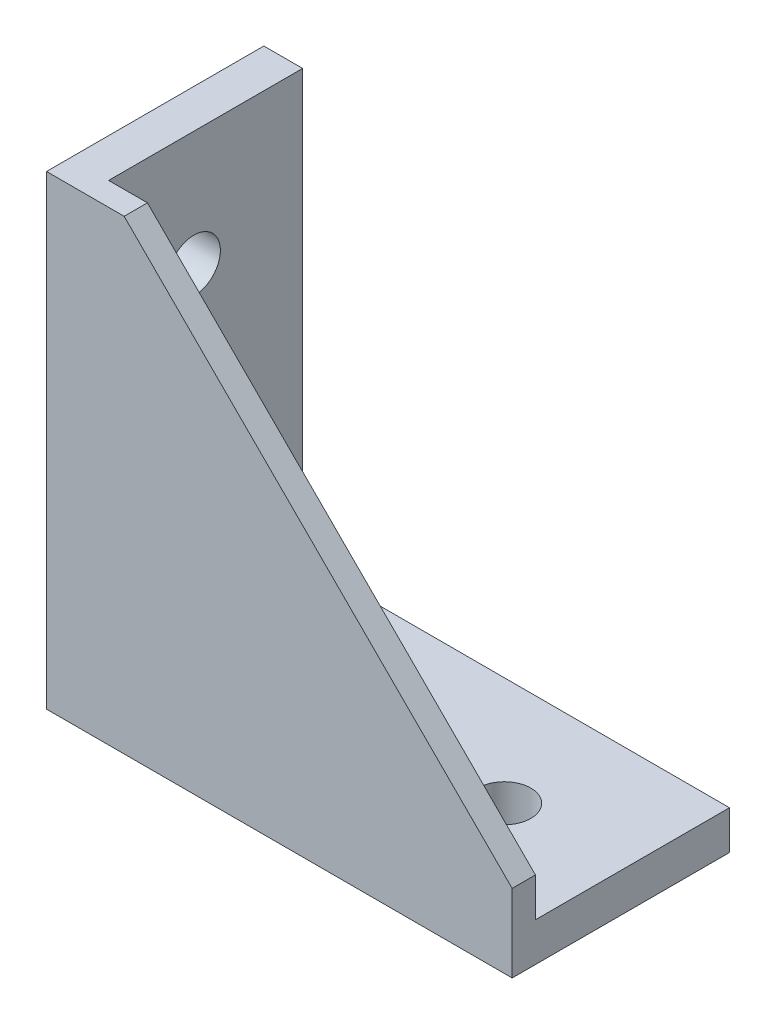
ISO-10303-21;
HEADER;
FILE_DESCRIPTION(('STEP AP214'),'2;1');
FILE_NAME('part.step','',(''),(''),'','','');
FILE_SCHEMA(('AUTOMOTIVE_DESIGN { 1 0 10303 214 1 1 1 1 }'));
ENDSEC;
DATA;
#1=APPLICATION_CONTEXT('core data for automotive mechanical design processes');
#2=APPLICATION_PROTOCOL_DEFINITION('international standard','automotive_design',2000,#1);
#3=PRODUCT_CONTEXT('',#1,'mechanical');
#4=PRODUCT('Part','Part','',(#3));
#5=PRODUCT_RELATED_PRODUCT_CATEGORY('part','',(#4));
#6=PRODUCT_DEFINITION_FORMATION('','',#4);
#7=PRODUCT_DEFINITION_CONTEXT('part definition',#1,'design');
#8=PRODUCT_DEFINITION('design','',#6,#7);
#9=PRODUCT_DEFINITION_SHAPE('','',#8);
#10=(LENGTH_UNIT() NAMED_UNIT(*) SI_UNIT(.MILLI.,.METRE.));
#11=(NAMED_UNIT(*) PLANE_ANGLE_UNIT() SI_UNIT($,.RADIAN.));
#12=(NAMED_UNIT(*) SI_UNIT($,.STERADIAN.) SOLID_ANGLE_UNIT());
#13=UNCERTAINTY_MEASURE_WITH_UNIT(LENGTH_MEASURE(1.E-05),#10,'distance_accuracy_value','');
#14=(GEOMETRIC_REPRESENTATION_CONTEXT(3) GLOBAL_UNCERTAINTY_ASSIGNED_CONTEXT((#13)) GLOBAL_UNIT_ASSIGNED_CONTEXT((#10,
#11,#12)) REPRESENTATION_CONTEXT('',''));
#15=CARTESIAN_POINT('',(0.,0.,0.));
#16=DIRECTION('',(0.,0.,1.));
#17=DIRECTION('',(1.,0.,0.));
#18=AXIS2_PLACEMENT_3D('',#15,#16,#17);
#19=CARTESIAN_POINT('',(0.,0.,14.));
#20=DIRECTION('',(0.,1.,0.));
#21=DIRECTION('',(0.,0.,1.));
#22=AXIS2_PLACEMENT_3D('',#19,#20,#21);
#23=PLANE('',#22);
#24=DIRECTION('',(0.,0.,1.));
#25=VECTOR('',#24,1.);
#26=CARTESIAN_POINT('',(5.5,0.,-4.));
#27=LINE('',#26,#25);
#28=CARTESIAN_POINT('',(5.5,0.,-4.));
#29=VERTEX_POINT('',#28);
#30=CARTESIAN_POINT('',(5.5,0.,4.));
#31=VERTEX_POINT('',#30);
#32=EDGE_CURVE('E395',#29,#31,#27,.T.);
#33=ORIENTED_EDGE('',*,*,#32,.F.);
#34=DIRECTION('',(1.,0.,0.));
#35=VECTOR('',#34,1.);
#36=CARTESIAN_POINT('',(3.,0.,-4.));
#37=LINE('',#36,#35);
#38=CARTESIAN_POINT('',(3.,0.,-4.));
#39=VERTEX_POINT('',#38);
#40=EDGE_CURVE('E400',#39,#29,#37,.T.);
#41=ORIENTED_EDGE('',*,*,#40,.F.);
#42=DIRECTION('',(0.,0.,-1.));
#43=VECTOR('',#42,1.);
#44=CARTESIAN_POINT('',(3.,0.,-4.));
#45=LINE('',#44,#43);
#46=CARTESIAN_POINT('',(3.,0.,4.));
#47=VERTEX_POINT('',#46);
#48=EDGE_CURVE('E412',#47,#39,#45,.T.);
#49=ORIENTED_EDGE('',*,*,#48,.F.);
#50=DIRECTION('',(-1.,0.,0.));
#51=VECTOR('',#50,1.);
#52=CARTESIAN_POINT('',(3.,0.,4.));
#53=LINE('',#52,#51);
#54=EDGE_CURVE('E409',#31,#47,#53,.T.);
#55=ORIENTED_EDGE('',*,*,#54,.F.);
#56=EDGE_LOOP('',(#33,#41,#49,#55));
#57=FACE_BOUND('',#56,.T.);
#58=DIRECTION('',(-1.,0.,0.));
#59=VECTOR('',#58,1.);
#60=CARTESIAN_POINT('',(18.,0.,-3.4));
#61=LINE('',#60,#59);
#62=CARTESIAN_POINT('',(31.5,0.,-3.4));
#63=VERTEX_POINT('',#62);
#64=CARTESIAN_POINT('',(18.,0.,-3.4));
#65=VERTEX_POINT('',#64);
#66=EDGE_CURVE('E439',#63,#65,#61,.T.);
#67=ORIENTED_EDGE('',*,*,#66,.T.);
#68=CARTESIAN_POINT('',(18.,0.,0.));
#69=DIRECTION('',(0.,1.,0.));
#70=DIRECTION('',(0.,0.,1.));
#71=AXIS2_PLACEMENT_3D('',#68,#69,#70);
#72=CIRCLE('',#71,3.4);
#73=CARTESIAN_POINT('',(18.,0.,3.4));
#74=VERTEX_POINT('',#73);
#75=EDGE_CURVE('E429',#65,#74,#72,.T.);
#76=ORIENTED_EDGE('',*,*,#75,.T.);
#77=DIRECTION('',(1.,0.,0.));
#78=VECTOR('',#77,1.);
#79=CARTESIAN_POINT('',(18.,0.,3.4));
#80=LINE('',#79,#78);
#81=CARTESIAN_POINT('',(31.5,0.,3.4));
#82=VERTEX_POINT('',#81);
#83=EDGE_CURVE('E432',#74,#82,#80,.T.);
#84=ORIENTED_EDGE('',*,*,#83,.T.);
#85=CARTESIAN_POINT('',(31.5,0.,0.));
#86=DIRECTION('',(0.,1.,0.));
#87=DIRECTION('',(0.,0.,1.));
#88=AXIS2_PLACEMENT_3D('',#85,#86,#87);
#89=CIRCLE('',#88,3.4);
#90=EDGE_CURVE('E436',#82,#63,#89,.T.);
#91=ORIENTED_EDGE('',*,*,#90,.T.);
#92=EDGE_LOOP('',(#67,#76,#84,#91));
#93=FACE_BOUND('',#92,.T.);
#94=CARTESIAN_POINT('',(45.,0.,0.));
#95=DIRECTION('',(0.,1.,0.));
#96=DIRECTION('',(0.,0.,1.));
#97=AXIS2_PLACEMENT_3D('',#94,#95,#96);
#98=CIRCLE('',#97,3.4);
#99=CARTESIAN_POINT('',(45.,0.,3.4));
#100=VERTEX_POINT('',#99);
#101=EDGE_CURVE('E446',#100,#100,#98,.T.);
#102=ORIENTED_EDGE('',*,*,#101,.T.);
#103=EDGE_LOOP('',(#102));
#104=FACE_BOUND('',#103,.T.);
#105=DIRECTION('',(1.,0.,0.));
#106=VECTOR('',#105,1.);
#107=CARTESIAN_POINT('',(0.,0.,-14.));
#108=LINE('',#107,#106);
#109=CARTESIAN_POINT('',(0.,0.,-14.));
#110=VERTEX_POINT('',#109);
#111=CARTESIAN_POINT('',(60.,0.,-14.));
#112=VERTEX_POINT('',#111);
#113=EDGE_CURVE('E506',#110,#112,#108,.T.);
#114=ORIENTED_EDGE('',*,*,#113,.T.);
#115=DIRECTION('',(0.,0.,-1.));
#116=VECTOR('',#115,1.);
#117=CARTESIAN_POINT('',(60.,0.,14.));
#118=LINE('',#117,#116);
#119=CARTESIAN_POINT('',(60.,0.,14.));
#120=VERTEX_POINT('',#119);
#121=EDGE_CURVE('E521',#120,#112,#118,.T.);
#122=ORIENTED_EDGE('',*,*,#121,.F.);
#123=DIRECTION('',(1.,0.,0.));
#124=VECTOR('',#123,1.);
#125=CARTESIAN_POINT('',(0.,0.,14.));
#126=LINE('',#125,#124);
#127=CARTESIAN_POINT('',(0.,0.,14.));
#128=VERTEX_POINT('',#127);
#129=EDGE_CURVE('E497',#128,#120,#126,.T.);
#130=ORIENTED_EDGE('',*,*,#129,.F.);
#131=DIRECTION('',(0.,0.,-1.));
#132=VECTOR('',#131,1.);
#133=CARTESIAN_POINT('',(0.,0.,14.));
#134=LINE('',#133,#132);
#135=EDGE_CURVE('E54',#128,#110,#134,.T.);
#136=ORIENTED_EDGE('',*,*,#135,.T.);
#137=EDGE_LOOP('',(#114,#122,#130,#136));
#138=FACE_BOUND('',#137,.T.);
#139=DIRECTION('',(0.,0.,1.));
#140=VECTOR('',#139,1.);
#141=CARTESIAN_POINT('',(57.,0.,-4.));
#142=LINE('',#141,#140);
#143=CARTESIAN_POINT('',(57.,0.,-4.));
#144=VERTEX_POINT('',#143);
#145=CARTESIAN_POINT('',(57.,0.,4.));
#146=VERTEX_POINT('',#145);
#147=EDGE_CURVE('E352',#144,#146,#142,.T.);
#148=ORIENTED_EDGE('',*,*,#147,.F.);
#149=DIRECTION('',(1.,0.,0.));
#150=VECTOR('',#149,1.);
#151=CARTESIAN_POINT('',(54.5,0.,-4.));
#152=LINE('',#151,#150);
#153=CARTESIAN_POINT('',(54.5,0.,-4.));
#154=VERTEX_POINT('',#153);
#155=EDGE_CURVE('E367',#154,#144,#152,.T.);
#156=ORIENTED_EDGE('',*,*,#155,.F.);
#157=DIRECTION('',(0.,0.,-1.));
#158=VECTOR('',#157,1.);
#159=CARTESIAN_POINT('',(54.5,0.,-4.));
#160=LINE('',#159,#158);
#161=CARTESIAN_POINT('',(54.5,0.,4.));
#162=VERTEX_POINT('',#161);
#163=EDGE_CURVE('E379',#162,#154,#160,.T.);
#164=ORIENTED_EDGE('',*,*,#163,.F.);
#165=DIRECTION('',(-1.,0.,0.));
#166=VECTOR('',#165,1.);
#167=CARTESIAN_POINT('',(54.5,0.,4.));
#168=LINE('',#167,#166);
#169=EDGE_CURVE('E376',#146,#162,#168,.T.);
#170=ORIENTED_EDGE('',*,*,#169,.F.);
#171=EDGE_LOOP('',(#148,#156,#164,#170));
#172=FACE_BOUND('',#171,.T.);
#173=ADVANCED_FACE('F46',(#57,#93,#104,#138,#172),#23,.F.);
#174=CARTESIAN_POINT('',(5.,60.,14.));
#175=DIRECTION('',(0.,-1.,0.));
#176=DIRECTION('',(0.,0.,-1.));
#177=AXIS2_PLACEMENT_3D('',#174,#175,#176);
#178=PLANE('',#177);
#179=DIRECTION('',(-1.,0.,0.));
#180=VECTOR('',#179,1.);
#181=CARTESIAN_POINT('',(5.,60.,-14.));
#182=LINE('',#181,#180);
#183=CARTESIAN_POINT('',(5.,60.,-14.));
#184=VERTEX_POINT('',#183);
#185=CARTESIAN_POINT('',(0.,60.,-14.));
#186=VERTEX_POINT('',#185);
#187=EDGE_CURVE('E488',#184,#186,#182,.T.);
#188=ORIENTED_EDGE('',*,*,#187,.T.);
#189=DIRECTION('',(0.,0.,-1.));
#190=VECTOR('',#189,1.);
#191=CARTESIAN_POINT('',(0.,60.,14.));
#192=LINE('',#191,#190);
#193=CARTESIAN_POINT('',(0.,60.,14.));
#194=VERTEX_POINT('',#193);
#195=EDGE_CURVE('E13',#194,#186,#192,.T.);
#196=ORIENTED_EDGE('',*,*,#195,.F.);
#197=DIRECTION('',(-1.,0.,0.));
#198=VECTOR('',#197,1.);
#199=CARTESIAN_POINT('',(5.,60.,14.));
#200=LINE('',#199,#198);
#201=CARTESIAN_POINT('',(10.,60.,14.));
#202=VERTEX_POINT('',#201);
#203=EDGE_CURVE('E491',#202,#194,#200,.T.);
#204=ORIENTED_EDGE('',*,*,#203,.F.);
#205=DIRECTION('',(0.,0.,1.));
#206=VECTOR('',#205,1.);
#207=CARTESIAN_POINT('',(10.,60.,11.));
#208=LINE('',#207,#206);
#209=CARTESIAN_POINT('',(10.,60.,11.));
#210=VERTEX_POINT('',#209);
#211=EDGE_CURVE('E485',#210,#202,#208,.T.);
#212=ORIENTED_EDGE('',*,*,#211,.F.);
#213=DIRECTION('',(-1.,0.,0.));
#214=VECTOR('',#213,1.);
#215=CARTESIAN_POINT('',(5.,60.,11.));
#216=LINE('',#215,#214);
#217=CARTESIAN_POINT('',(5.,60.,11.));
#218=VERTEX_POINT('',#217);
#219=EDGE_CURVE('E467',#210,#218,#216,.T.);
#220=ORIENTED_EDGE('',*,*,#219,.T.);
#221=DIRECTION('',(0.,0.,-1.));
#222=VECTOR('',#221,1.);
#223=CARTESIAN_POINT('',(5.,60.,14.));
#224=LINE('',#223,#222);
#225=EDGE_CURVE('E501',#218,#184,#224,.T.);
#226=ORIENTED_EDGE('',*,*,#225,.T.);
#227=EDGE_LOOP('',(#188,#196,#204,#212,#220,#226));
#228=FACE_BOUND('',#227,.T.);
#229=ADVANCED_FACE('F48',(#228),#178,.F.);
#230=CARTESIAN_POINT('',(0.,60.,14.));
#231=DIRECTION('',(1.,0.,0.));
#232=DIRECTION('',(0.,1.,0.));
#233=AXIS2_PLACEMENT_3D('',#230,#231,#232);
#234=PLANE('',#233);
#235=DIRECTION('',(0.,1.,0.));
#236=VECTOR('',#235,1.);
#237=CARTESIAN_POINT('',(0.,54.5,-4.));
#238=LINE('',#237,#236);
#239=CARTESIAN_POINT('',(0.,54.5,-4.));
#240=VERTEX_POINT('',#239);
#241=CARTESIAN_POINT('',(0.,57.,-4.));
#242=VERTEX_POINT('',#241);
#243=EDGE_CURVE('E287',#240,#242,#238,.T.);
#244=ORIENTED_EDGE('',*,*,#243,.T.);
#245=DIRECTION('',(0.,0.,1.));
#246=VECTOR('',#245,1.);
#247=CARTESIAN_POINT('',(0.,57.,-4.));
#248=LINE('',#247,#246);
#249=CARTESIAN_POINT('',(0.,57.,4.));
#250=VERTEX_POINT('',#249);
#251=EDGE_CURVE('E261',#242,#250,#248,.T.);
#252=ORIENTED_EDGE('',*,*,#251,.T.);
#253=DIRECTION('',(0.,-1.,0.));
#254=VECTOR('',#253,1.);
#255=CARTESIAN_POINT('',(0.,54.5,4.));
#256=LINE('',#255,#254);
#257=CARTESIAN_POINT('',(0.,54.5,4.));
#258=VERTEX_POINT('',#257);
#259=EDGE_CURVE('E277',#250,#258,#256,.T.);
#260=ORIENTED_EDGE('',*,*,#259,.T.);
#261=DIRECTION('',(0.,0.,-1.));
#262=VECTOR('',#261,1.);
#263=CARTESIAN_POINT('',(0.,54.5,-4.));
#264=LINE('',#263,#262);
#265=EDGE_CURVE('E61',#258,#240,#264,.T.);
#266=ORIENTED_EDGE('',*,*,#265,.T.);
#267=EDGE_LOOP('',(#244,#252,#260,#266));
#268=FACE_BOUND('',#267,.T.);
#269=DIRECTION('',(0.,1.,0.));
#270=VECTOR('',#269,1.);
#271=CARTESIAN_POINT('',(0.,3.,-4.));
#272=LINE('',#271,#270);
#273=CARTESIAN_POINT('',(0.,3.,-4.));
#274=VERTEX_POINT('',#273);
#275=CARTESIAN_POINT('',(0.,5.5,-4.));
#276=VERTEX_POINT('',#275);
#277=EDGE_CURVE('E312',#274,#276,#272,.T.);
#278=ORIENTED_EDGE('',*,*,#277,.T.);
#279=DIRECTION('',(0.,0.,1.));
#280=VECTOR('',#279,1.);
#281=CARTESIAN_POINT('',(0.,5.5,-4.));
#282=LINE('',#281,#280);
#283=CARTESIAN_POINT('',(0.,5.5,4.));
#284=VERTEX_POINT('',#283);
#285=EDGE_CURVE('E266',#276,#284,#282,.T.);
#286=ORIENTED_EDGE('',*,*,#285,.T.);
#287=DIRECTION('',(0.,-1.,0.));
#288=VECTOR('',#287,1.);
#289=CARTESIAN_POINT('',(0.,3.,4.));
#290=LINE('',#289,#288);
#291=CARTESIAN_POINT('',(0.,3.,4.));
#292=VERTEX_POINT('',#291);
#293=EDGE_CURVE('E300',#284,#292,#290,.T.);
#294=ORIENTED_EDGE('',*,*,#293,.T.);
#295=DIRECTION('',(0.,0.,-1.));
#296=VECTOR('',#295,1.);
#297=CARTESIAN_POINT('',(0.,3.,-4.));
#298=LINE('',#297,#296);
#299=EDGE_CURVE('E69',#292,#274,#298,.T.);
#300=ORIENTED_EDGE('',*,*,#299,.T.);
#301=EDGE_LOOP('',(#278,#286,#294,#300));
#302=FACE_BOUND('',#301,.T.);
#303=CARTESIAN_POINT('',(0.,18.,0.));
#304=DIRECTION('',(-1.,0.,0.));
#305=DIRECTION('',(0.,0.,1.));
#306=AXIS2_PLACEMENT_3D('',#303,#304,#305);
#307=CIRCLE('',#306,3.4);
#308=CARTESIAN_POINT('',(0.,18.,-3.4));
#309=VERTEX_POINT('',#308);
#310=CARTESIAN_POINT('',(0.,18.,3.4));
#311=VERTEX_POINT('',#310);
#312=EDGE_CURVE('E326',#309,#311,#307,.T.);
#313=ORIENTED_EDGE('',*,*,#312,.F.);
#314=DIRECTION('',(0.,-1.,0.));
#315=VECTOR('',#314,1.);
#316=CARTESIAN_POINT('',(0.,18.,-3.4));
#317=LINE('',#316,#315);
#318=CARTESIAN_POINT('',(0.,31.5,-3.4));
#319=VERTEX_POINT('',#318);
#320=EDGE_CURVE('E328',#319,#309,#317,.T.);
#321=ORIENTED_EDGE('',*,*,#320,.F.);
#322=CARTESIAN_POINT('',(0.,31.5,0.));
#323=DIRECTION('',(-1.,0.,0.));
#324=DIRECTION('',(0.,0.,1.));
#325=AXIS2_PLACEMENT_3D('',#322,#323,#324);
#326=CIRCLE('',#325,3.4);
#327=CARTESIAN_POINT('',(0.,31.5,3.4));
#328=VERTEX_POINT('',#327);
#329=EDGE_CURVE('E331',#328,#319,#326,.T.);
#330=ORIENTED_EDGE('',*,*,#329,.F.);
#331=DIRECTION('',(0.,1.,0.));
#332=VECTOR('',#331,1.);
#333=CARTESIAN_POINT('',(0.,18.,3.4));
#334=LINE('',#333,#332);
#335=EDGE_CURVE('E334',#311,#328,#334,.T.);
#336=ORIENTED_EDGE('',*,*,#335,.F.);
#337=EDGE_LOOP('',(#313,#321,#330,#336));
#338=FACE_BOUND('',#337,.T.);
#339=CARTESIAN_POINT('',(0.,45.,0.));
#340=DIRECTION('',(-1.,0.,0.));
#341=DIRECTION('',(0.,0.,1.));
#342=AXIS2_PLACEMENT_3D('',#339,#340,#341);
#343=CIRCLE('',#342,3.4);
#344=CARTESIAN_POINT('',(0.,45.,3.4));
#345=VERTEX_POINT('',#344);
#346=EDGE_CURVE('E341',#345,#345,#343,.T.);
#347=ORIENTED_EDGE('',*,*,#346,.F.);
#348=EDGE_LOOP('',(#347));
#349=FACE_BOUND('',#348,.T.);
#350=DIRECTION('',(0.,-1.,0.));
#351=VECTOR('',#350,1.);
#352=CARTESIAN_POINT('',(0.,60.,-14.));
#353=LINE('',#352,#351);
#354=EDGE_CURVE('E504',#186,#110,#353,.T.);
#355=ORIENTED_EDGE('',*,*,#354,.T.);
#356=ORIENTED_EDGE('',*,*,#135,.F.);
#357=DIRECTION('',(0.,-1.,0.));
#358=VECTOR('',#357,1.);
#359=CARTESIAN_POINT('',(0.,60.,14.));
#360=LINE('',#359,#358);
#361=EDGE_CURVE('E494',#194,#128,#360,.T.);
#362=ORIENTED_EDGE('',*,*,#361,.F.);
#363=ORIENTED_EDGE('',*,*,#195,.T.);
#364=EDGE_LOOP('',(#355,#356,#362,#363));
#365=FACE_BOUND('',#364,.T.);
#366=ADVANCED_FACE('F545',(#268,#302,#338,#349,#365),#234,.F.);
#367=CARTESIAN_POINT('',(60.,0.,14.));
#368=DIRECTION('',(-1.,0.,0.));
#369=DIRECTION('',(0.,0.,1.));
#370=AXIS2_PLACEMENT_3D('',#367,#368,#369);
#371=PLANE('',#370);
#372=DIRECTION('',(0.,1.,0.));
#373=VECTOR('',#372,1.);
#374=CARTESIAN_POINT('',(60.,0.,-14.));
#375=LINE('',#374,#373);
#376=CARTESIAN_POINT('',(60.,5.,-14.));
#377=VERTEX_POINT('',#376);
#378=EDGE_CURVE('E508',#112,#377,#375,.T.);
#379=ORIENTED_EDGE('',*,*,#378,.T.);
#380=DIRECTION('',(0.,0.,-1.));
#381=VECTOR('',#380,1.);
#382=CARTESIAN_POINT('',(60.,5.,14.));
#383=LINE('',#382,#381);
#384=CARTESIAN_POINT('',(60.,5.,11.));
#385=VERTEX_POINT('',#384);
#386=EDGE_CURVE('E519',#385,#377,#383,.T.);
#387=ORIENTED_EDGE('',*,*,#386,.F.);
#388=DIRECTION('',(0.,1.,0.));
#389=VECTOR('',#388,1.);
#390=CARTESIAN_POINT('',(60.,10.,11.));
#391=LINE('',#390,#389);
#392=CARTESIAN_POINT('',(60.,10.,11.));
#393=VERTEX_POINT('',#392);
#394=EDGE_CURVE('E476',#385,#393,#391,.T.);
#395=ORIENTED_EDGE('',*,*,#394,.T.);
#396=DIRECTION('',(0.,0.,1.));
#397=VECTOR('',#396,1.);
#398=CARTESIAN_POINT('',(60.,10.,11.));
#399=LINE('',#398,#397);
#400=CARTESIAN_POINT('',(60.,10.,14.));
#401=VERTEX_POINT('',#400);
#402=EDGE_CURVE('E482',#393,#401,#399,.T.);
#403=ORIENTED_EDGE('',*,*,#402,.T.);
#404=DIRECTION('',(0.,1.,0.));
#405=VECTOR('',#404,1.);
#406=CARTESIAN_POINT('',(60.,0.,14.));
#407=LINE('',#406,#405);
#408=EDGE_CURVE('E499',#120,#401,#407,.T.);
#409=ORIENTED_EDGE('',*,*,#408,.F.);
#410=ORIENTED_EDGE('',*,*,#121,.T.);
#411=EDGE_LOOP('',(#379,#387,#395,#403,#409,#410));
#412=FACE_BOUND('',#411,.T.);
#413=ADVANCED_FACE('F539',(#412),#371,.F.);
#414=CARTESIAN_POINT('',(5.00000000000001,5.,14.));
#415=DIRECTION('',(0.,-1.,0.));
#416=DIRECTION('',(0.,0.,-1.));
#417=AXIS2_PLACEMENT_3D('',#414,#415,#416);
#418=PLANE('',#417);
#419=DIRECTION('',(1.,0.,0.));
#420=VECTOR('',#419,1.);
#421=CARTESIAN_POINT('',(18.,5.,3.4));
#422=LINE('',#421,#420);
#423=CARTESIAN_POINT('',(18.,5.,3.4));
#424=VERTEX_POINT('',#423);
#425=CARTESIAN_POINT('',(31.5,5.,3.4));
#426=VERTEX_POINT('',#425);
#427=EDGE_CURVE('E445',#424,#426,#422,.T.);
#428=ORIENTED_EDGE('',*,*,#427,.F.);
#429=CARTESIAN_POINT('',(18.,5.,0.));
#430=DIRECTION('',(0.,1.,0.));
#431=DIRECTION('',(0.,0.,1.));
#432=AXIS2_PLACEMENT_3D('',#429,#430,#431);
#433=CIRCLE('',#432,3.4);
#434=CARTESIAN_POINT('',(18.,5.,-3.4));
#435=VERTEX_POINT('',#434);
#436=EDGE_CURVE('E443',#435,#424,#433,.T.);
#437=ORIENTED_EDGE('',*,*,#436,.F.);
#438=DIRECTION('',(-1.,0.,0.));
#439=VECTOR('',#438,1.);
#440=CARTESIAN_POINT('',(18.,5.,-3.4));
#441=LINE('',#440,#439);
#442=CARTESIAN_POINT('',(31.5,5.,-3.4));
#443=VERTEX_POINT('',#442);
#444=EDGE_CURVE('E433',#443,#435,#441,.T.);
#445=ORIENTED_EDGE('',*,*,#444,.F.);
#446=CARTESIAN_POINT('',(31.5,5.,0.));
#447=DIRECTION('',(0.,1.,0.));
#448=DIRECTION('',(0.,0.,1.));
#449=AXIS2_PLACEMENT_3D('',#446,#447,#448);
#450=CIRCLE('',#449,3.4);
#451=EDGE_CURVE('E449',#426,#443,#450,.T.);
#452=ORIENTED_EDGE('',*,*,#451,.F.);
#453=EDGE_LOOP('',(#428,#437,#445,#452));
#454=FACE_BOUND('',#453,.T.);
#455=CARTESIAN_POINT('',(45.,5.,0.));
#456=DIRECTION('',(0.,1.,0.));
#457=DIRECTION('',(0.,0.,1.));
#458=AXIS2_PLACEMENT_3D('',#455,#456,#457);
#459=CIRCLE('',#458,3.4);
#460=CARTESIAN_POINT('',(45.,5.,3.4));
#461=VERTEX_POINT('',#460);
#462=EDGE_CURVE('E428',#461,#461,#459,.T.);
#463=ORIENTED_EDGE('',*,*,#462,.F.);
#464=EDGE_LOOP('',(#463));
#465=FACE_BOUND('',#464,.T.);
#466=DIRECTION('',(0.,0.,-1.));
#467=VECTOR('',#466,1.);
#468=CARTESIAN_POINT('',(5.00000000000001,5.,14.));
#469=LINE('',#468,#467);
#470=CARTESIAN_POINT('',(5.00000000000001,5.,11.));
#471=VERTEX_POINT('',#470);
#472=CARTESIAN_POINT('',(5.00000000000001,5.,-14.));
#473=VERTEX_POINT('',#472);
#474=EDGE_CURVE('E517',#471,#473,#469,.T.);
#475=ORIENTED_EDGE('',*,*,#474,.F.);
#476=DIRECTION('',(1.,0.,0.));
#477=VECTOR('',#476,1.);
#478=CARTESIAN_POINT('',(60.,5.,11.));
#479=LINE('',#478,#477);
#480=EDGE_CURVE('E473',#471,#385,#479,.T.);
#481=ORIENTED_EDGE('',*,*,#480,.T.);
#482=ORIENTED_EDGE('',*,*,#386,.T.);
#483=DIRECTION('',(-1.,0.,0.));
#484=VECTOR('',#483,1.);
#485=CARTESIAN_POINT('',(5.00000000000001,5.,-14.));
#486=LINE('',#485,#484);
#487=EDGE_CURVE('E511',#377,#473,#486,.T.);
#488=ORIENTED_EDGE('',*,*,#487,.T.);
#489=EDGE_LOOP('',(#475,#481,#482,#488));
#490=FACE_BOUND('',#489,.T.);
#491=ADVANCED_FACE('F552',(#454,#465,#490),#418,.F.);
#492=CARTESIAN_POINT('',(5.,60.,14.));
#493=DIRECTION('',(-1.,0.,0.));
#494=DIRECTION('',(0.,-1.,0.));
#495=AXIS2_PLACEMENT_3D('',#492,#493,#494);
#496=PLANE('',#495);
#497=CARTESIAN_POINT('',(5.,18.,0.));
#498=DIRECTION('',(-1.,0.,0.));
#499=DIRECTION('',(0.,0.,1.));
#500=AXIS2_PLACEMENT_3D('',#497,#498,#499);
#501=CIRCLE('',#500,3.4);
#502=CARTESIAN_POINT('',(5.00000000000001,18.,-3.4));
#503=VERTEX_POINT('',#502);
#504=CARTESIAN_POINT('',(5.,18.,3.4));
#505=VERTEX_POINT('',#504);
#506=EDGE_CURVE('E337',#503,#505,#501,.T.);
#507=ORIENTED_EDGE('',*,*,#506,.T.);
#508=DIRECTION('',(0.,1.,0.));
#509=VECTOR('',#508,1.);
#510=CARTESIAN_POINT('',(5.,18.,3.4));
#511=LINE('',#510,#509);
#512=CARTESIAN_POINT('',(5.00000000000001,31.5,3.4));
#513=VERTEX_POINT('',#512);
#514=EDGE_CURVE('E329',#505,#513,#511,.T.);
#515=ORIENTED_EDGE('',*,*,#514,.T.);
#516=CARTESIAN_POINT('',(5.00000000000001,31.5,0.));
#517=DIRECTION('',(-1.,0.,0.));
#518=DIRECTION('',(0.,0.,1.));
#519=AXIS2_PLACEMENT_3D('',#516,#517,#518);
#520=CIRCLE('',#519,3.4);
#521=CARTESIAN_POINT('',(5.00000000000001,31.5,-3.4));
#522=VERTEX_POINT('',#521);
#523=EDGE_CURVE('E344',#513,#522,#520,.T.);
#524=ORIENTED_EDGE('',*,*,#523,.T.);
#525=DIRECTION('',(0.,-1.,0.));
#526=VECTOR('',#525,1.);
#527=CARTESIAN_POINT('',(5.,18.,-3.4));
#528=LINE('',#527,#526);
#529=EDGE_CURVE('E340',#522,#503,#528,.T.);
#530=ORIENTED_EDGE('',*,*,#529,.T.);
#531=EDGE_LOOP('',(#507,#515,#524,#530));
#532=FACE_BOUND('',#531,.T.);
#533=CARTESIAN_POINT('',(5.00000000000001,45.,0.));
#534=DIRECTION('',(-1.,0.,0.));
#535=DIRECTION('',(0.,0.,1.));
#536=AXIS2_PLACEMENT_3D('',#533,#534,#535);
#537=CIRCLE('',#536,3.4);
#538=CARTESIAN_POINT('',(5.00000000000001,45.,3.4));
#539=VERTEX_POINT('',#538);
#540=EDGE_CURVE('E325',#539,#539,#537,.T.);
#541=ORIENTED_EDGE('',*,*,#540,.T.);
#542=EDGE_LOOP('',(#541));
#543=FACE_BOUND('',#542,.T.);
#544=ORIENTED_EDGE('',*,*,#225,.F.);
#545=DIRECTION('',(0.,-1.,0.));
#546=VECTOR('',#545,1.);
#547=CARTESIAN_POINT('',(5.00000000000001,5.,11.));
#548=LINE('',#547,#546);
#549=EDGE_CURVE('E470',#218,#471,#548,.T.);
#550=ORIENTED_EDGE('',*,*,#549,.T.);
#551=ORIENTED_EDGE('',*,*,#474,.T.);
#552=DIRECTION('',(0.,1.,0.));
#553=VECTOR('',#552,1.);
#554=CARTESIAN_POINT('',(5.,60.,-14.));
#555=LINE('',#554,#553);
#556=EDGE_CURVE('E495',#473,#184,#555,.T.);
#557=ORIENTED_EDGE('',*,*,#556,.T.);
#558=EDGE_LOOP('',(#544,#550,#551,#557));
#559=FACE_BOUND('',#558,.T.);
#560=ADVANCED_FACE('F549',(#532,#543,#559),#496,.F.);
#561=CARTESIAN_POINT('',(0.,0.,14.));
#562=DIRECTION('',(0.,0.,1.));
#563=DIRECTION('',(1.,0.,0.));
#564=AXIS2_PLACEMENT_3D('',#561,#562,#563);
#565=PLANE('',#564);
#566=ORIENTED_EDGE('',*,*,#203,.T.);
#567=ORIENTED_EDGE('',*,*,#361,.T.);
#568=ORIENTED_EDGE('',*,*,#129,.T.);
#569=ORIENTED_EDGE('',*,*,#408,.T.);
#570=DIRECTION('',(-0.707106781186547,0.707106781186547,0.));
#571=VECTOR('',#570,1.);
#572=CARTESIAN_POINT('',(10.,60.,14.));
#573=LINE('',#572,#571);
#574=EDGE_CURVE('E456',#401,#202,#573,.T.);
#575=ORIENTED_EDGE('',*,*,#574,.T.);
#576=EDGE_LOOP('',(#566,#567,#568,#569,#575));
#577=FACE_BOUND('',#576,.T.);
#578=ADVANCED_FACE('F543',(#577),#565,.T.);
#579=CARTESIAN_POINT('',(0.,0.,-14.));
#580=DIRECTION('',(0.,0.,1.));
#581=DIRECTION('',(1.,0.,0.));
#582=AXIS2_PLACEMENT_3D('',#579,#580,#581);
#583=PLANE('',#582);
#584=ORIENTED_EDGE('',*,*,#187,.F.);
#585=ORIENTED_EDGE('',*,*,#556,.F.);
#586=ORIENTED_EDGE('',*,*,#487,.F.);
#587=ORIENTED_EDGE('',*,*,#378,.F.);
#588=ORIENTED_EDGE('',*,*,#113,.F.);
#589=ORIENTED_EDGE('',*,*,#354,.F.);
#590=EDGE_LOOP('',(#584,#585,#586,#587,#588,#589));
#591=FACE_BOUND('',#590,.T.);
#592=ADVANCED_FACE('F534',(#591),#583,.F.);
#593=CARTESIAN_POINT('',(10.,60.,11.));
#594=DIRECTION('',(0.707106781186548,0.707106781186548,0.));
#595=DIRECTION('',(-0.707106781186548,0.707106781186548,0.));
#596=AXIS2_PLACEMENT_3D('',#593,#594,#595);
#597=PLANE('',#596);
#598=ORIENTED_EDGE('',*,*,#574,.F.);
#599=ORIENTED_EDGE('',*,*,#402,.F.);
#600=DIRECTION('',(-0.707106781186547,0.707106781186547,0.));
#601=VECTOR('',#600,1.);
#602=CARTESIAN_POINT('',(10.,60.,11.));
#603=LINE('',#602,#601);
#604=EDGE_CURVE('E479',#393,#210,#603,.T.);
#605=ORIENTED_EDGE('',*,*,#604,.T.);
#606=ORIENTED_EDGE('',*,*,#211,.T.);
#607=EDGE_LOOP('',(#598,#599,#605,#606));
#608=FACE_BOUND('',#607,.T.);
#609=ADVANCED_FACE('F558',(#608),#597,.T.);
#610=CARTESIAN_POINT('',(0.,0.,11.));
#611=DIRECTION('',(0.,0.,-1.));
#612=DIRECTION('',(-1.,0.,0.));
#613=AXIS2_PLACEMENT_3D('',#610,#611,#612);
#614=PLANE('',#613);
#615=ORIENTED_EDGE('',*,*,#219,.F.);
#616=ORIENTED_EDGE('',*,*,#604,.F.);
#617=ORIENTED_EDGE('',*,*,#394,.F.);
#618=ORIENTED_EDGE('',*,*,#480,.F.);
#619=ORIENTED_EDGE('',*,*,#549,.F.);
#620=EDGE_LOOP('',(#615,#616,#617,#618,#619));
#621=FACE_BOUND('',#620,.T.);
#622=ADVANCED_FACE('F555',(#621),#614,.T.);
#623=CARTESIAN_POINT('',(45.,0.,0.));
#624=DIRECTION('',(0.,1.,0.));
#625=DIRECTION('',(0.,0.,1.));
#626=AXIS2_PLACEMENT_3D('',#623,#624,#625);
#627=CYLINDRICAL_SURFACE('',#626,3.4);
#628=ORIENTED_EDGE('',*,*,#101,.F.);
#629=EDGE_LOOP('',(#628));
#630=FACE_BOUND('',#629,.T.);
#631=ORIENTED_EDGE('',*,*,#462,.T.);
#632=EDGE_LOOP('',(#631));
#633=FACE_BOUND('',#632,.T.);
#634=ADVANCED_FACE('F565',(#630,#633),#627,.F.);
#635=CARTESIAN_POINT('',(18.,0.,0.));
#636=DIRECTION('',(0.,1.,0.));
#637=DIRECTION('',(0.,0.,1.));
#638=AXIS2_PLACEMENT_3D('',#635,#636,#637);
#639=CYLINDRICAL_SURFACE('',#638,3.4);
#640=ORIENTED_EDGE('',*,*,#436,.T.);
#641=DIRECTION('',(0.,1.,0.));
#642=VECTOR('',#641,1.);
#643=CARTESIAN_POINT('',(18.,0.,3.4));
#644=LINE('',#643,#642);
#645=EDGE_CURVE('E442',#74,#424,#644,.T.);
#646=ORIENTED_EDGE('',*,*,#645,.F.);
#647=ORIENTED_EDGE('',*,*,#75,.F.);
#648=DIRECTION('',(0.,1.,0.));
#649=VECTOR('',#648,1.);
#650=CARTESIAN_POINT('',(18.,0.,-3.4));
#651=LINE('',#650,#649);
#652=EDGE_CURVE('E454',#65,#435,#651,.T.);
#653=ORIENTED_EDGE('',*,*,#652,.T.);
#654=EDGE_LOOP('',(#640,#646,#647,#653));
#655=FACE_BOUND('',#654,.T.);
#656=ADVANCED_FACE('F679',(#655),#639,.F.);
#657=CARTESIAN_POINT('',(18.,0.,-3.4));
#658=DIRECTION('',(0.,0.,-1.));
#659=DIRECTION('',(-1.,0.,0.));
#660=AXIS2_PLACEMENT_3D('',#657,#658,#659);
#661=PLANE('',#660);
#662=ORIENTED_EDGE('',*,*,#444,.T.);
#663=ORIENTED_EDGE('',*,*,#652,.F.);
#664=ORIENTED_EDGE('',*,*,#66,.F.);
#665=DIRECTION('',(0.,1.,0.));
#666=VECTOR('',#665,1.);
#667=CARTESIAN_POINT('',(31.5,0.,-3.4));
#668=LINE('',#667,#666);
#669=EDGE_CURVE('E457',#63,#443,#668,.T.);
#670=ORIENTED_EDGE('',*,*,#669,.T.);
#671=EDGE_LOOP('',(#662,#663,#664,#670));
#672=FACE_BOUND('',#671,.T.);
#673=ADVANCED_FACE('F675',(#672),#661,.F.);
#674=CARTESIAN_POINT('',(31.5,0.,0.));
#675=DIRECTION('',(0.,1.,0.));
#676=DIRECTION('',(0.,0.,1.));
#677=AXIS2_PLACEMENT_3D('',#674,#675,#676);
#678=CYLINDRICAL_SURFACE('',#677,3.4);
#679=ORIENTED_EDGE('',*,*,#451,.T.);
#680=ORIENTED_EDGE('',*,*,#669,.F.);
#681=ORIENTED_EDGE('',*,*,#90,.F.);
#682=DIRECTION('',(0.,1.,0.));
#683=VECTOR('',#682,1.);
#684=CARTESIAN_POINT('',(31.5,0.,3.4));
#685=LINE('',#684,#683);
#686=EDGE_CURVE('E459',#82,#426,#685,.T.);
#687=ORIENTED_EDGE('',*,*,#686,.T.);
#688=EDGE_LOOP('',(#679,#680,#681,#687));
#689=FACE_BOUND('',#688,.T.);
#690=ADVANCED_FACE('F678',(#689),#678,.F.);
#691=CARTESIAN_POINT('',(18.,0.,3.4));
#692=DIRECTION('',(0.,0.,1.));
#693=DIRECTION('',(1.,0.,0.));
#694=AXIS2_PLACEMENT_3D('',#691,#692,#693);
#695=PLANE('',#694);
#696=ORIENTED_EDGE('',*,*,#427,.T.);
#697=ORIENTED_EDGE('',*,*,#686,.F.);
#698=ORIENTED_EDGE('',*,*,#83,.F.);
#699=ORIENTED_EDGE('',*,*,#645,.T.);
#700=EDGE_LOOP('',(#696,#697,#698,#699));
#701=FACE_BOUND('',#700,.T.);
#702=ADVANCED_FACE('F673',(#701),#695,.F.);
#703=CARTESIAN_POINT('',(5.5,-2.5,-4.));
#704=DIRECTION('',(-1.,0.,0.));
#705=DIRECTION('',(0.,0.,1.));
#706=AXIS2_PLACEMENT_3D('',#703,#704,#705);
#707=PLANE('',#706);
#708=ORIENTED_EDGE('',*,*,#32,.T.);
#709=DIRECTION('',(0.,1.,0.));
#710=VECTOR('',#709,1.);
#711=CARTESIAN_POINT('',(5.5,-2.5,4.));
#712=LINE('',#711,#710);
#713=CARTESIAN_POINT('',(5.5,-2.5,4.));
#714=VERTEX_POINT('',#713);
#715=EDGE_CURVE('E425',#714,#31,#712,.T.);
#716=ORIENTED_EDGE('',*,*,#715,.F.);
#717=DIRECTION('',(0.,0.,1.));
#718=VECTOR('',#717,1.);
#719=CARTESIAN_POINT('',(5.5,-2.5,-4.));
#720=LINE('',#719,#718);
#721=CARTESIAN_POINT('',(5.5,-2.5,-4.));
#722=VERTEX_POINT('',#721);
#723=EDGE_CURVE('E396',#722,#714,#720,.T.);
#724=ORIENTED_EDGE('',*,*,#723,.F.);
#725=DIRECTION('',(0.,1.,0.));
#726=VECTOR('',#725,1.);
#727=CARTESIAN_POINT('',(5.5,-2.5,-4.));
#728=LINE('',#727,#726);
#729=EDGE_CURVE('E406',#722,#29,#728,.T.);
#730=ORIENTED_EDGE('',*,*,#729,.T.);
#731=EDGE_LOOP('',(#708,#716,#724,#730));
#732=FACE_BOUND('',#731,.T.);
#733=ADVANCED_FACE('F669',(#732),#707,.F.);
#734=CARTESIAN_POINT('',(3.,-2.5,4.));
#735=DIRECTION('',(0.,0.,-1.));
#736=DIRECTION('',(-1.,0.,0.));
#737=AXIS2_PLACEMENT_3D('',#734,#735,#736);
#738=PLANE('',#737);
#739=ORIENTED_EDGE('',*,*,#54,.T.);
#740=DIRECTION('',(0.,1.,0.));
#741=VECTOR('',#740,1.);
#742=CARTESIAN_POINT('',(3.,-2.5,4.));
#743=LINE('',#742,#741);
#744=CARTESIAN_POINT('',(3.,-2.5,4.));
#745=VERTEX_POINT('',#744);
#746=EDGE_CURVE('E422',#745,#47,#743,.T.);
#747=ORIENTED_EDGE('',*,*,#746,.F.);
#748=DIRECTION('',(-1.,0.,0.));
#749=VECTOR('',#748,1.);
#750=CARTESIAN_POINT('',(3.,-2.5,4.));
#751=LINE('',#750,#749);
#752=EDGE_CURVE('E399',#714,#745,#751,.T.);
#753=ORIENTED_EDGE('',*,*,#752,.F.);
#754=ORIENTED_EDGE('',*,*,#715,.T.);
#755=EDGE_LOOP('',(#739,#747,#753,#754));
#756=FACE_BOUND('',#755,.T.);
#757=ADVANCED_FACE('F665',(#756),#738,.F.);
#758=CARTESIAN_POINT('',(3.,-2.5,-4.));
#759=DIRECTION('',(1.,0.,0.));
#760=DIRECTION('',(0.,0.,-1.));
#761=AXIS2_PLACEMENT_3D('',#758,#759,#760);
#762=PLANE('',#761);
#763=ORIENTED_EDGE('',*,*,#48,.T.);
#764=DIRECTION('',(0.,1.,0.));
#765=VECTOR('',#764,1.);
#766=CARTESIAN_POINT('',(3.,-2.5,-4.));
#767=LINE('',#766,#765);
#768=CARTESIAN_POINT('',(3.,-2.5,-4.));
#769=VERTEX_POINT('',#768);
#770=EDGE_CURVE('E419',#769,#39,#767,.T.);
#771=ORIENTED_EDGE('',*,*,#770,.F.);
#772=DIRECTION('',(0.,0.,-1.));
#773=VECTOR('',#772,1.);
#774=CARTESIAN_POINT('',(3.,-2.5,-4.));
#775=LINE('',#774,#773);
#776=EDGE_CURVE('E402',#745,#769,#775,.T.);
#777=ORIENTED_EDGE('',*,*,#776,.F.);
#778=ORIENTED_EDGE('',*,*,#746,.T.);
#779=EDGE_LOOP('',(#763,#771,#777,#778));
#780=FACE_BOUND('',#779,.T.);
#781=ADVANCED_FACE('F661',(#780),#762,.F.);
#782=CARTESIAN_POINT('',(3.,-2.5,-4.));
#783=DIRECTION('',(0.,0.,1.));
#784=DIRECTION('',(1.,0.,0.));
#785=AXIS2_PLACEMENT_3D('',#782,#783,#784);
#786=PLANE('',#785);
#787=ORIENTED_EDGE('',*,*,#40,.T.);
#788=ORIENTED_EDGE('',*,*,#729,.F.);
#789=DIRECTION('',(1.,0.,0.));
#790=VECTOR('',#789,1.);
#791=CARTESIAN_POINT('',(3.,-2.5,-4.));
#792=LINE('',#791,#790);
#793=EDGE_CURVE('E404',#769,#722,#792,.T.);
#794=ORIENTED_EDGE('',*,*,#793,.F.);
#795=ORIENTED_EDGE('',*,*,#770,.T.);
#796=EDGE_LOOP('',(#787,#788,#794,#795));
#797=FACE_BOUND('',#796,.T.);
#798=ADVANCED_FACE('F657',(#797),#786,.F.);
#799=CARTESIAN_POINT('',(0.,-2.5,0.));
#800=DIRECTION('',(0.,1.,0.));
#801=DIRECTION('',(0.,0.,1.));
#802=AXIS2_PLACEMENT_3D('',#799,#800,#801);
#803=PLANE('',#802);
#804=ORIENTED_EDGE('',*,*,#723,.T.);
#805=ORIENTED_EDGE('',*,*,#752,.T.);
#806=ORIENTED_EDGE('',*,*,#776,.T.);
#807=ORIENTED_EDGE('',*,*,#793,.T.);
#808=EDGE_LOOP('',(#804,#805,#806,#807));
#809=FACE_BOUND('',#808,.T.);
#810=ADVANCED_FACE('F653',(#809),#803,.F.);
#811=CARTESIAN_POINT('',(57.,-2.5,-4.));
#812=DIRECTION('',(-1.,0.,0.));
#813=DIRECTION('',(0.,0.,1.));
#814=AXIS2_PLACEMENT_3D('',#811,#812,#813);
#815=PLANE('',#814);
#816=ORIENTED_EDGE('',*,*,#147,.T.);
#817=DIRECTION('',(0.,1.,0.));
#818=VECTOR('',#817,1.);
#819=CARTESIAN_POINT('',(57.,-2.5,4.));
#820=LINE('',#819,#818);
#821=CARTESIAN_POINT('',(57.,-2.5,4.));
#822=VERTEX_POINT('',#821);
#823=EDGE_CURVE('E392',#822,#146,#820,.T.);
#824=ORIENTED_EDGE('',*,*,#823,.F.);
#825=DIRECTION('',(0.,0.,1.));
#826=VECTOR('',#825,1.);
#827=CARTESIAN_POINT('',(57.,-2.5,-4.));
#828=LINE('',#827,#826);
#829=CARTESIAN_POINT('',(57.,-2.5,-4.));
#830=VERTEX_POINT('',#829);
#831=EDGE_CURVE('E363',#830,#822,#828,.T.);
#832=ORIENTED_EDGE('',*,*,#831,.F.);
#833=DIRECTION('',(0.,1.,0.));
#834=VECTOR('',#833,1.);
#835=CARTESIAN_POINT('',(57.,-2.5,-4.));
#836=LINE('',#835,#834);
#837=EDGE_CURVE('E373',#830,#144,#836,.T.);
#838=ORIENTED_EDGE('',*,*,#837,.T.);
#839=EDGE_LOOP('',(#816,#824,#832,#838));
#840=FACE_BOUND('',#839,.T.);
#841=ADVANCED_FACE('F649',(#840),#815,.F.);
#842=CARTESIAN_POINT('',(54.5,-2.5,4.));
#843=DIRECTION('',(0.,0.,-1.));
#844=DIRECTION('',(-1.,0.,0.));
#845=AXIS2_PLACEMENT_3D('',#842,#843,#844);
#846=PLANE('',#845);
#847=ORIENTED_EDGE('',*,*,#169,.T.);
#848=DIRECTION('',(0.,1.,0.));
#849=VECTOR('',#848,1.);
#850=CARTESIAN_POINT('',(54.5,-2.5,4.));
#851=LINE('',#850,#849);
#852=CARTESIAN_POINT('',(54.5,-2.5,4.));
#853=VERTEX_POINT('',#852);
#854=EDGE_CURVE('E389',#853,#162,#851,.T.);
#855=ORIENTED_EDGE('',*,*,#854,.F.);
#856=DIRECTION('',(-1.,0.,0.));
#857=VECTOR('',#856,1.);
#858=CARTESIAN_POINT('',(54.5,-2.5,4.));
#859=LINE('',#858,#857);
#860=EDGE_CURVE('E366',#822,#853,#859,.T.);
#861=ORIENTED_EDGE('',*,*,#860,.F.);
#862=ORIENTED_EDGE('',*,*,#823,.T.);
#863=EDGE_LOOP('',(#847,#855,#861,#862));
#864=FACE_BOUND('',#863,.T.);
#865=ADVANCED_FACE('F645',(#864),#846,.F.);
#866=CARTESIAN_POINT('',(54.5,-2.5,-4.));
#867=DIRECTION('',(1.,0.,0.));
#868=DIRECTION('',(0.,0.,-1.));
#869=AXIS2_PLACEMENT_3D('',#866,#867,#868);
#870=PLANE('',#869);
#871=ORIENTED_EDGE('',*,*,#163,.T.);
#872=DIRECTION('',(0.,1.,0.));
#873=VECTOR('',#872,1.);
#874=CARTESIAN_POINT('',(54.5,-2.5,-4.));
#875=LINE('',#874,#873);
#876=CARTESIAN_POINT('',(54.5,-2.5,-4.));
#877=VERTEX_POINT('',#876);
#878=EDGE_CURVE('E386',#877,#154,#875,.T.);
#879=ORIENTED_EDGE('',*,*,#878,.F.);
#880=DIRECTION('',(0.,0.,-1.));
#881=VECTOR('',#880,1.);
#882=CARTESIAN_POINT('',(54.5,-2.5,-4.));
#883=LINE('',#882,#881);
#884=EDGE_CURVE('E369',#853,#877,#883,.T.);
#885=ORIENTED_EDGE('',*,*,#884,.F.);
#886=ORIENTED_EDGE('',*,*,#854,.T.);
#887=EDGE_LOOP('',(#871,#879,#885,#886));
#888=FACE_BOUND('',#887,.T.);
#889=ADVANCED_FACE('F641',(#888),#870,.F.);
#890=CARTESIAN_POINT('',(54.5,-2.5,-4.));
#891=DIRECTION('',(0.,0.,1.));
#892=DIRECTION('',(1.,0.,0.));
#893=AXIS2_PLACEMENT_3D('',#890,#891,#892);
#894=PLANE('',#893);
#895=ORIENTED_EDGE('',*,*,#155,.T.);
#896=ORIENTED_EDGE('',*,*,#837,.F.);
#897=DIRECTION('',(1.,0.,0.));
#898=VECTOR('',#897,1.);
#899=CARTESIAN_POINT('',(54.5,-2.5,-4.));
#900=LINE('',#899,#898);
#901=EDGE_CURVE('E371',#877,#830,#900,.T.);
#902=ORIENTED_EDGE('',*,*,#901,.F.);
#903=ORIENTED_EDGE('',*,*,#878,.T.);
#904=EDGE_LOOP('',(#895,#896,#902,#903));
#905=FACE_BOUND('',#904,.T.);
#906=ADVANCED_FACE('F637',(#905),#894,.F.);
#907=CARTESIAN_POINT('',(0.,-2.5,0.));
#908=DIRECTION('',(0.,1.,0.));
#909=DIRECTION('',(0.,0.,1.));
#910=AXIS2_PLACEMENT_3D('',#907,#908,#909);
#911=PLANE('',#910);
#912=ORIENTED_EDGE('',*,*,#831,.T.);
#913=ORIENTED_EDGE('',*,*,#860,.T.);
#914=ORIENTED_EDGE('',*,*,#884,.T.);
#915=ORIENTED_EDGE('',*,*,#901,.T.);
#916=EDGE_LOOP('',(#912,#913,#914,#915));
#917=FACE_BOUND('',#916,.T.);
#918=ADVANCED_FACE('F596',(#917),#911,.F.);
#919=CARTESIAN_POINT('',(0.,45.,0.));
#920=DIRECTION('',(1.,0.,0.));
#921=DIRECTION('',(0.,1.,0.));
#922=AXIS2_PLACEMENT_3D('',#919,#920,#921);
#923=CYLINDRICAL_SURFACE('',#922,3.4);
#924=ORIENTED_EDGE('',*,*,#346,.T.);
#925=EDGE_LOOP('',(#924));
#926=FACE_BOUND('',#925,.T.);
#927=ORIENTED_EDGE('',*,*,#540,.F.);
#928=EDGE_LOOP('',(#927));
#929=FACE_BOUND('',#928,.T.);
#930=ADVANCED_FACE('F592',(#926,#929),#923,.F.);
#931=CARTESIAN_POINT('',(0.,18.,0.));
#932=DIRECTION('',(1.,0.,0.));
#933=DIRECTION('',(0.,1.,0.));
#934=AXIS2_PLACEMENT_3D('',#931,#932,#933);
#935=CYLINDRICAL_SURFACE('',#934,3.4);
#936=ORIENTED_EDGE('',*,*,#506,.F.);
#937=DIRECTION('',(1.,0.,0.));
#938=VECTOR('',#937,1.);
#939=CARTESIAN_POINT('',(0.,18.,-3.4));
#940=LINE('',#939,#938);
#941=EDGE_CURVE('E336',#309,#503,#940,.T.);
#942=ORIENTED_EDGE('',*,*,#941,.F.);
#943=ORIENTED_EDGE('',*,*,#312,.T.);
#944=DIRECTION('',(1.,0.,0.));
#945=VECTOR('',#944,1.);
#946=CARTESIAN_POINT('',(0.,18.,3.4));
#947=LINE('',#946,#945);
#948=EDGE_CURVE('E349',#311,#505,#947,.T.);
#949=ORIENTED_EDGE('',*,*,#948,.T.);
#950=EDGE_LOOP('',(#936,#942,#943,#949));
#951=FACE_BOUND('',#950,.T.);
#952=ADVANCED_FACE('F595',(#951),#935,.F.);
#953=CARTESIAN_POINT('',(0.,18.,3.4));
#954=DIRECTION('',(0.,0.,-1.));
#955=DIRECTION('',(-1.,0.,0.));
#956=AXIS2_PLACEMENT_3D('',#953,#954,#955);
#957=PLANE('',#956);
#958=ORIENTED_EDGE('',*,*,#514,.F.);
#959=ORIENTED_EDGE('',*,*,#948,.F.);
#960=ORIENTED_EDGE('',*,*,#335,.T.);
#961=DIRECTION('',(1.,0.,0.));
#962=VECTOR('',#961,1.);
#963=CARTESIAN_POINT('',(0.,31.5,3.4));
#964=LINE('',#963,#962);
#965=EDGE_CURVE('E353',#328,#513,#964,.T.);
#966=ORIENTED_EDGE('',*,*,#965,.T.);
#967=EDGE_LOOP('',(#958,#959,#960,#966));
#968=FACE_BOUND('',#967,.T.);
#969=ADVANCED_FACE('F620',(#968),#957,.T.);
#970=CARTESIAN_POINT('',(0.,31.5,0.));
#971=DIRECTION('',(1.,0.,0.));
#972=DIRECTION('',(0.,1.,0.));
#973=AXIS2_PLACEMENT_3D('',#970,#971,#972);
#974=CYLINDRICAL_SURFACE('',#973,3.4);
#975=ORIENTED_EDGE('',*,*,#523,.F.);
#976=ORIENTED_EDGE('',*,*,#965,.F.);
#977=ORIENTED_EDGE('',*,*,#329,.T.);
#978=DIRECTION('',(1.,0.,0.));
#979=VECTOR('',#978,1.);
#980=CARTESIAN_POINT('',(0.,31.5,-3.4));
#981=LINE('',#980,#979);
#982=EDGE_CURVE('E355',#319,#522,#981,.T.);
#983=ORIENTED_EDGE('',*,*,#982,.T.);
#984=EDGE_LOOP('',(#975,#976,#977,#983));
#985=FACE_BOUND('',#984,.T.);
#986=ADVANCED_FACE('F618',(#985),#974,.F.);
#987=CARTESIAN_POINT('',(0.,18.,-3.4));
#988=DIRECTION('',(0.,0.,1.));
#989=DIRECTION('',(1.,0.,0.));
#990=AXIS2_PLACEMENT_3D('',#987,#988,#989);
#991=PLANE('',#990);
#992=ORIENTED_EDGE('',*,*,#529,.F.);
#993=ORIENTED_EDGE('',*,*,#982,.F.);
#994=ORIENTED_EDGE('',*,*,#320,.T.);
#995=ORIENTED_EDGE('',*,*,#941,.T.);
#996=EDGE_LOOP('',(#992,#993,#994,#995));
#997=FACE_BOUND('',#996,.T.);
#998=ADVANCED_FACE('F613',(#997),#991,.T.);
#999=CARTESIAN_POINT('',(-2.5,5.5,-4.));
#1000=DIRECTION('',(0.,1.,0.));
#1001=DIRECTION('',(-1.,0.,0.));
#1002=AXIS2_PLACEMENT_3D('',#999,#1000,#1001);
#1003=PLANE('',#1002);
#1004=ORIENTED_EDGE('',*,*,#285,.F.);
#1005=DIRECTION('',(1.,0.,0.));
#1006=VECTOR('',#1005,1.);
#1007=CARTESIAN_POINT('',(-2.5,5.5,-4.));
#1008=LINE('',#1007,#1006);
#1009=CARTESIAN_POINT('',(-2.5,5.5,-4.));
#1010=VERTEX_POINT('',#1009);
#1011=EDGE_CURVE('E323',#1010,#276,#1008,.T.);
#1012=ORIENTED_EDGE('',*,*,#1011,.F.);
#1013=DIRECTION('',(0.,0.,1.));
#1014=VECTOR('',#1013,1.);
#1015=CARTESIAN_POINT('',(-2.5,5.5,-4.));
#1016=LINE('',#1015,#1014);
#1017=CARTESIAN_POINT('',(-2.5,5.5,4.));
#1018=VERTEX_POINT('',#1017);
#1019=EDGE_CURVE('E296',#1010,#1018,#1016,.T.);
#1020=ORIENTED_EDGE('',*,*,#1019,.T.);
#1021=DIRECTION('',(1.,0.,0.));
#1022=VECTOR('',#1021,1.);
#1023=CARTESIAN_POINT('',(-2.5,5.5,4.));
#1024=LINE('',#1023,#1022);
#1025=EDGE_CURVE('E309',#1018,#284,#1024,.T.);
#1026=ORIENTED_EDGE('',*,*,#1025,.T.);
#1027=EDGE_LOOP('',(#1004,#1012,#1020,#1026));
#1028=FACE_BOUND('',#1027,.T.);
#1029=ADVANCED_FACE('F630',(#1028),#1003,.T.);
#1030=CARTESIAN_POINT('',(-2.5,3.,-4.));
#1031=DIRECTION('',(0.,0.,-1.));
#1032=DIRECTION('',(0.,1.,0.));
#1033=AXIS2_PLACEMENT_3D('',#1030,#1031,#1032);
#1034=PLANE('',#1033);
#1035=ORIENTED_EDGE('',*,*,#277,.F.);
#1036=DIRECTION('',(1.,0.,0.));
#1037=VECTOR('',#1036,1.);
#1038=CARTESIAN_POINT('',(-2.5,3.,-4.));
#1039=LINE('',#1038,#1037);
#1040=CARTESIAN_POINT('',(-2.5,3.,-4.));
#1041=VERTEX_POINT('',#1040);
#1042=EDGE_CURVE('E321',#1041,#274,#1039,.T.);
#1043=ORIENTED_EDGE('',*,*,#1042,.F.);
#1044=DIRECTION('',(0.,1.,0.));
#1045=VECTOR('',#1044,1.);
#1046=CARTESIAN_POINT('',(-2.5,3.,-4.));
#1047=LINE('',#1046,#1045);
#1048=EDGE_CURVE('E299',#1041,#1010,#1047,.T.);
#1049=ORIENTED_EDGE('',*,*,#1048,.T.);
#1050=ORIENTED_EDGE('',*,*,#1011,.T.);
#1051=EDGE_LOOP('',(#1035,#1043,#1049,#1050));
#1052=FACE_BOUND('',#1051,.T.);
#1053=ADVANCED_FACE('F791',(#1052),#1034,.T.);
#1054=CARTESIAN_POINT('',(-2.5,3.,-4.));
#1055=DIRECTION('',(0.,-1.,0.));
#1056=DIRECTION('',(1.,0.,0.));
#1057=AXIS2_PLACEMENT_3D('',#1054,#1055,#1056);
#1058=PLANE('',#1057);
#1059=ORIENTED_EDGE('',*,*,#299,.F.);
#1060=DIRECTION('',(1.,0.,0.));
#1061=VECTOR('',#1060,1.);
#1062=CARTESIAN_POINT('',(-2.5,3.,4.));
#1063=LINE('',#1062,#1061);
#1064=CARTESIAN_POINT('',(-2.5,3.,4.));
#1065=VERTEX_POINT('',#1064);
#1066=EDGE_CURVE('E319',#1065,#292,#1063,.T.);
#1067=ORIENTED_EDGE('',*,*,#1066,.F.);
#1068=DIRECTION('',(0.,0.,-1.));
#1069=VECTOR('',#1068,1.);
#1070=CARTESIAN_POINT('',(-2.5,3.,-4.));
#1071=LINE('',#1070,#1069);
#1072=EDGE_CURVE('E303',#1065,#1041,#1071,.T.);
#1073=ORIENTED_EDGE('',*,*,#1072,.T.);
#1074=ORIENTED_EDGE('',*,*,#1042,.T.);
#1075=EDGE_LOOP('',(#1059,#1067,#1073,#1074));
#1076=FACE_BOUND('',#1075,.T.);
#1077=ADVANCED_FACE('F800',(#1076),#1058,.T.);
#1078=CARTESIAN_POINT('',(-2.5,3.,4.));
#1079=DIRECTION('',(0.,0.,1.));
#1080=DIRECTION('',(0.,-1.,0.));
#1081=AXIS2_PLACEMENT_3D('',#1078,#1079,#1080);
#1082=PLANE('',#1081);
#1083=ORIENTED_EDGE('',*,*,#293,.F.);
#1084=ORIENTED_EDGE('',*,*,#1025,.F.);
#1085=DIRECTION('',(0.,-1.,0.));
#1086=VECTOR('',#1085,1.);
#1087=CARTESIAN_POINT('',(-2.5,3.,4.));
#1088=LINE('',#1087,#1086);
#1089=EDGE_CURVE('E306',#1018,#1065,#1088,.T.);
#1090=ORIENTED_EDGE('',*,*,#1089,.T.);
#1091=ORIENTED_EDGE('',*,*,#1066,.T.);
#1092=EDGE_LOOP('',(#1083,#1084,#1090,#1091));
#1093=FACE_BOUND('',#1092,.T.);
#1094=ADVANCED_FACE('F809',(#1093),#1082,.T.);
#1095=CARTESIAN_POINT('',(-2.5,0.,0.));
#1096=DIRECTION('',(1.,0.,0.));
#1097=DIRECTION('',(0.,0.,1.));
#1098=AXIS2_PLACEMENT_3D('',#1095,#1096,#1097);
#1099=PLANE('',#1098);
#1100=ORIENTED_EDGE('',*,*,#1019,.F.);
#1101=ORIENTED_EDGE('',*,*,#1048,.F.);
#1102=ORIENTED_EDGE('',*,*,#1072,.F.);
#1103=ORIENTED_EDGE('',*,*,#1089,.F.);
#1104=EDGE_LOOP('',(#1100,#1101,#1102,#1103));
#1105=FACE_BOUND('',#1104,.T.);
#1106=ADVANCED_FACE('F818',(#1105),#1099,.F.);
#1107=CARTESIAN_POINT('',(-2.49999999999999,57.,-4.));
#1108=DIRECTION('',(0.,1.,0.));
#1109=DIRECTION('',(-1.,0.,0.));
#1110=AXIS2_PLACEMENT_3D('',#1107,#1108,#1109);
#1111=PLANE('',#1110);
#1112=ORIENTED_EDGE('',*,*,#251,.F.);
#1113=DIRECTION('',(1.,0.,0.));
#1114=VECTOR('',#1113,1.);
#1115=CARTESIAN_POINT('',(-2.49999999999999,57.,-4.));
#1116=LINE('',#1115,#1114);
#1117=CARTESIAN_POINT('',(-2.49999999999999,57.,-4.));
#1118=VERTEX_POINT('',#1117);
#1119=EDGE_CURVE('E255',#1118,#242,#1116,.T.);
#1120=ORIENTED_EDGE('',*,*,#1119,.F.);
#1121=DIRECTION('',(0.,0.,1.));
#1122=VECTOR('',#1121,1.);
#1123=CARTESIAN_POINT('',(-2.49999999999999,57.,-4.));
#1124=LINE('',#1123,#1122);
#1125=CARTESIAN_POINT('',(-2.49999999999999,57.,4.));
#1126=VERTEX_POINT('',#1125);
#1127=EDGE_CURVE('E258',#1118,#1126,#1124,.T.);
#1128=ORIENTED_EDGE('',*,*,#1127,.T.);
#1129=DIRECTION('',(1.,0.,0.));
#1130=VECTOR('',#1129,1.);
#1131=CARTESIAN_POINT('',(-2.49999999999999,57.,4.));
#1132=LINE('',#1131,#1130);
#1133=EDGE_CURVE('E285',#1126,#250,#1132,.T.);
#1134=ORIENTED_EDGE('',*,*,#1133,.T.);
#1135=EDGE_LOOP('',(#1112,#1120,#1128,#1134));
#1136=FACE_BOUND('',#1135,.T.);
#1137=ADVANCED_FACE('F257',(#1136),#1111,.T.);
#1138=CARTESIAN_POINT('',(-2.49999999999999,54.5,-4.));
#1139=DIRECTION('',(0.,0.,-1.));
#1140=DIRECTION('',(-1.,0.,0.));
#1141=AXIS2_PLACEMENT_3D('',#1138,#1139,#1140);
#1142=PLANE('',#1141);
#1143=ORIENTED_EDGE('',*,*,#243,.F.);
#1144=DIRECTION('',(1.,0.,0.));
#1145=VECTOR('',#1144,1.);
#1146=CARTESIAN_POINT('',(-2.49999999999999,54.5,-4.));
#1147=LINE('',#1146,#1145);
#1148=CARTESIAN_POINT('',(-2.49999999999999,54.5,-4.));
#1149=VERTEX_POINT('',#1148);
#1150=EDGE_CURVE('E267',#1149,#240,#1147,.T.);
#1151=ORIENTED_EDGE('',*,*,#1150,.F.);
#1152=DIRECTION('',(0.,1.,0.));
#1153=VECTOR('',#1152,1.);
#1154=CARTESIAN_POINT('',(-2.49999999999999,54.5,-4.));
#1155=LINE('',#1154,#1153);
#1156=EDGE_CURVE('E273',#1149,#1118,#1155,.T.);
#1157=ORIENTED_EDGE('',*,*,#1156,.T.);
#1158=ORIENTED_EDGE('',*,*,#1119,.T.);
#1159=EDGE_LOOP('',(#1143,#1151,#1157,#1158));
#1160=FACE_BOUND('',#1159,.T.);
#1161=ADVANCED_FACE('F279',(#1160),#1142,.T.);
#1162=CARTESIAN_POINT('',(-2.49999999999999,54.5,-4.));
#1163=DIRECTION('',(0.,-1.,0.));
#1164=DIRECTION('',(1.,0.,0.));
#1165=AXIS2_PLACEMENT_3D('',#1162,#1163,#1164);
#1166=PLANE('',#1165);
#1167=ORIENTED_EDGE('',*,*,#265,.F.);
#1168=DIRECTION('',(1.,0.,0.));
#1169=VECTOR('',#1168,1.);
#1170=CARTESIAN_POINT('',(-2.49999999999999,54.5,4.));
#1171=LINE('',#1170,#1169);
#1172=CARTESIAN_POINT('',(-2.49999999999999,54.5,4.));
#1173=VERTEX_POINT('',#1172);
#1174=EDGE_CURVE('E293',#1173,#258,#1171,.T.);
#1175=ORIENTED_EDGE('',*,*,#1174,.F.);
#1176=DIRECTION('',(0.,0.,-1.));
#1177=VECTOR('',#1176,1.);
#1178=CARTESIAN_POINT('',(-2.49999999999999,54.5,-4.));
#1179=LINE('',#1178,#1177);
#1180=EDGE_CURVE('E280',#1173,#1149,#1179,.T.);
#1181=ORIENTED_EDGE('',*,*,#1180,.T.);
#1182=ORIENTED_EDGE('',*,*,#1150,.T.);
#1183=EDGE_LOOP('',(#1167,#1175,#1181,#1182));
#1184=FACE_BOUND('',#1183,.T.);
#1185=ADVANCED_FACE('F845',(#1184),#1166,.T.);
#1186=CARTESIAN_POINT('',(-2.49999999999999,54.5,4.));
#1187=DIRECTION('',(0.,0.,1.));
#1188=DIRECTION('',(1.,0.,0.));
#1189=AXIS2_PLACEMENT_3D('',#1186,#1187,#1188);
#1190=PLANE('',#1189);
#1191=ORIENTED_EDGE('',*,*,#259,.F.);
#1192=ORIENTED_EDGE('',*,*,#1133,.F.);
#1193=DIRECTION('',(0.,-1.,0.));
#1194=VECTOR('',#1193,1.);
#1195=CARTESIAN_POINT('',(-2.49999999999999,54.5,4.));
#1196=LINE('',#1195,#1194);
#1197=EDGE_CURVE('E276',#1126,#1173,#1196,.T.);
#1198=ORIENTED_EDGE('',*,*,#1197,.T.);
#1199=ORIENTED_EDGE('',*,*,#1174,.T.);
#1200=EDGE_LOOP('',(#1191,#1192,#1198,#1199));
#1201=FACE_BOUND('',#1200,.T.);
#1202=ADVANCED_FACE('F854',(#1201),#1190,.T.);
#1203=CARTESIAN_POINT('',(-2.5,0.,0.));
#1204=DIRECTION('',(1.,0.,0.));
#1205=DIRECTION('',(0.,0.,1.));
#1206=AXIS2_PLACEMENT_3D('',#1203,#1204,#1205);
#1207=PLANE('',#1206);
#1208=ORIENTED_EDGE('',*,*,#1127,.F.);
#1209=ORIENTED_EDGE('',*,*,#1156,.F.);
#1210=ORIENTED_EDGE('',*,*,#1180,.F.);
#1211=ORIENTED_EDGE('',*,*,#1197,.F.);
#1212=EDGE_LOOP('',(#1208,#1209,#1210,#1211));
#1213=FACE_BOUND('',#1212,.T.);
#1214=ADVANCED_FACE('F271',(#1213),#1207,.F.);
#1215=CLOSED_SHELL('',(#173,#229,#366,#413,#491,#560,#578,#592,#609,#622,#634,#656,#673,#690,
#702,#733,#757,#781,#798,#810,#841,#865,#889,#906,#918,#930,#952,#969,#986,#998,#1029,#1053,
#1077,#1094,#1106,#1137,#1161,#1185,#1202,#1214));
#1216=MANIFOLD_SOLID_BREP('B2',#1215);
#1217=ADVANCED_BREP_SHAPE_REPRESENTATION('',(#18,#1216),#14);
#1218=SHAPE_DEFINITION_REPRESENTATION(#9,#1217);
ENDSEC;
END-ISO-10303-21;
